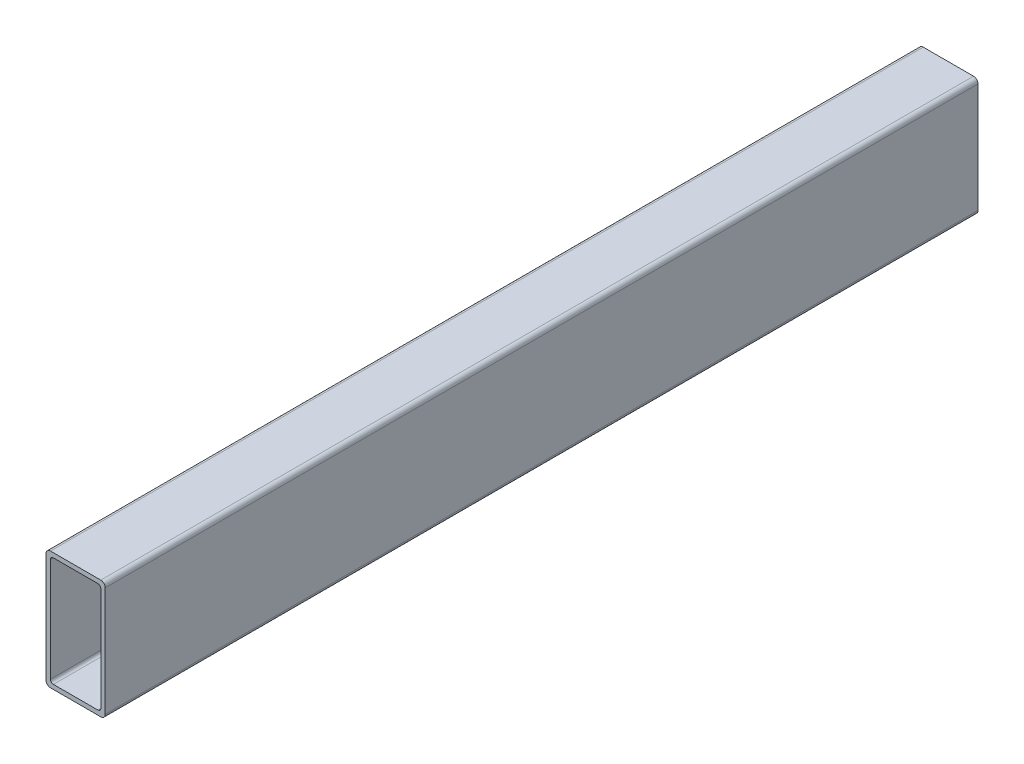
ISO-10303-21;
HEADER;
FILE_DESCRIPTION(('STEP AP214'),'2;1');
FILE_NAME('part.step','',(''),(''),'','','');
FILE_SCHEMA(('AUTOMOTIVE_DESIGN { 1 0 10303 214 1 1 1 1 }'));
ENDSEC;
DATA;
#1=APPLICATION_CONTEXT('core data for automotive mechanical design processes');
#2=APPLICATION_PROTOCOL_DEFINITION('international standard','automotive_design',2000,#1);
#3=PRODUCT_CONTEXT('',#1,'mechanical');
#4=PRODUCT('Part','Part','',(#3));
#5=PRODUCT_RELATED_PRODUCT_CATEGORY('part','',(#4));
#6=PRODUCT_DEFINITION_FORMATION('','',#4);
#7=PRODUCT_DEFINITION_CONTEXT('part definition',#1,'design');
#8=PRODUCT_DEFINITION('design','',#6,#7);
#9=PRODUCT_DEFINITION_SHAPE('','',#8);
#10=(LENGTH_UNIT() NAMED_UNIT(*) SI_UNIT(.MILLI.,.METRE.));
#11=(NAMED_UNIT(*) PLANE_ANGLE_UNIT() SI_UNIT($,.RADIAN.));
#12=(NAMED_UNIT(*) SI_UNIT($,.STERADIAN.) SOLID_ANGLE_UNIT());
#13=UNCERTAINTY_MEASURE_WITH_UNIT(LENGTH_MEASURE(1.E-05),#10,'distance_accuracy_value','');
#14=(GEOMETRIC_REPRESENTATION_CONTEXT(3) GLOBAL_UNCERTAINTY_ASSIGNED_CONTEXT((#13)) GLOBAL_UNIT_ASSIGNED_CONTEXT((#10,
#11,#12)) REPRESENTATION_CONTEXT('',''));
#15=CARTESIAN_POINT('',(0.,0.,0.));
#16=DIRECTION('',(0.,0.,1.));
#17=DIRECTION('',(1.,0.,0.));
#18=AXIS2_PLACEMENT_3D('',#15,#16,#17);
#19=CARTESIAN_POINT('',(0.,1.50000000000036,349.454556998328));
#20=DIRECTION('',(1.,0.,0.));
#21=DIRECTION('',(0.,1.,0.));
#22=AXIS2_PLACEMENT_3D('',#19,#20,#21);
#23=PLANE('',#22);
#24=DIRECTION('',(0.,-1.,0.));
#25=VECTOR('',#24,1.);
#26=CARTESIAN_POINT('',(0.,1.50000000000036,294.733197448332));
#27=LINE('',#26,#25);
#28=CARTESIAN_POINT('',(0.,38.5000000000004,294.733197448332));
#29=VERTEX_POINT('',#28);
#30=CARTESIAN_POINT('',(0.,1.50000000000036,294.733197448332));
#31=VERTEX_POINT('',#30);
#32=EDGE_CURVE('E306',#29,#31,#27,.T.);
#33=ORIENTED_EDGE('',*,*,#32,.F.);
#34=DIRECTION('',(0.,0.,-1.));
#35=VECTOR('',#34,1.);
#36=CARTESIAN_POINT('',(0.,38.5000000000004,349.454556998328));
#37=LINE('',#36,#35);
#38=CARTESIAN_POINT('',(0.,38.5000000000004,0.));
#39=VERTEX_POINT('',#38);
#40=EDGE_CURVE('E50',#29,#39,#37,.T.);
#41=ORIENTED_EDGE('',*,*,#40,.T.);
#42=DIRECTION('',(0.,-1.,0.));
#43=VECTOR('',#42,1.);
#44=CARTESIAN_POINT('',(0.,1.50000000000036,0.));
#45=LINE('',#44,#43);
#46=CARTESIAN_POINT('',(0.,1.50000000000036,0.));
#47=VERTEX_POINT('',#46);
#48=EDGE_CURVE('E201',#39,#47,#45,.T.);
#49=ORIENTED_EDGE('',*,*,#48,.T.);
#50=DIRECTION('',(0.,0.,-1.));
#51=VECTOR('',#50,1.);
#52=CARTESIAN_POINT('',(0.,1.50000000000036,349.454556998328));
#53=LINE('',#52,#51);
#54=EDGE_CURVE('E204',#31,#47,#53,.T.);
#55=ORIENTED_EDGE('',*,*,#54,.F.);
#56=EDGE_LOOP('',(#33,#41,#49,#55));
#57=FACE_BOUND('',#56,.T.);
#58=ADVANCED_FACE('F35',(#57),#23,.F.);
#59=CARTESIAN_POINT('',(1.5,38.5000000000004,349.454556998328));
#60=DIRECTION('',(0.,0.,-1.));
#61=DIRECTION('',(-1.,0.,0.));
#62=AXIS2_PLACEMENT_3D('',#59,#60,#61);
#63=CYLINDRICAL_SURFACE('',#62,1.5);
#64=CARTESIAN_POINT('',(1.5,38.5000000000004,294.733197448332));
#65=DIRECTION('',(0.,0.,1.));
#66=DIRECTION('',(1.,0.,0.));
#67=AXIS2_PLACEMENT_3D('',#64,#65,#66);
#68=CIRCLE('',#67,1.5);
#69=CARTESIAN_POINT('',(1.50000000000002,40.0000000000004,294.733197448332));
#70=VERTEX_POINT('',#69);
#71=EDGE_CURVE('E242',#70,#29,#68,.T.);
#72=ORIENTED_EDGE('',*,*,#71,.F.);
#73=DIRECTION('',(0.,0.,-1.));
#74=VECTOR('',#73,1.);
#75=CARTESIAN_POINT('',(1.50000000000002,40.0000000000004,349.454556998328));
#76=LINE('',#75,#74);
#77=CARTESIAN_POINT('',(1.50000000000002,40.0000000000004,0.));
#78=VERTEX_POINT('',#77);
#79=EDGE_CURVE('E207',#70,#78,#76,.T.);
#80=ORIENTED_EDGE('',*,*,#79,.T.);
#81=CARTESIAN_POINT('',(1.5,38.5000000000004,0.));
#82=DIRECTION('',(0.,0.,1.));
#83=DIRECTION('',(-1.,0.,0.));
#84=AXIS2_PLACEMENT_3D('',#81,#82,#83);
#85=CIRCLE('',#84,1.5);
#86=EDGE_CURVE('E199',#78,#39,#85,.T.);
#87=ORIENTED_EDGE('',*,*,#86,.T.);
#88=ORIENTED_EDGE('',*,*,#40,.F.);
#89=EDGE_LOOP('',(#72,#80,#87,#88));
#90=FACE_BOUND('',#89,.T.);
#91=ADVANCED_FACE('F239',(#90),#63,.T.);
#92=CARTESIAN_POINT('',(18.5,40.0000000000004,349.454556998328));
#93=DIRECTION('',(0.,-1.,0.));
#94=DIRECTION('',(0.,0.,-1.));
#95=AXIS2_PLACEMENT_3D('',#92,#93,#94);
#96=PLANE('',#95);
#97=DIRECTION('',(-1.,0.,0.));
#98=VECTOR('',#97,1.);
#99=CARTESIAN_POINT('',(18.5,40.0000000000004,294.733197448332));
#100=LINE('',#99,#98);
#101=CARTESIAN_POINT('',(18.5,40.0000000000004,294.733197448332));
#102=VERTEX_POINT('',#101);
#103=EDGE_CURVE('E247',#102,#70,#100,.T.);
#104=ORIENTED_EDGE('',*,*,#103,.F.);
#105=DIRECTION('',(0.,0.,-1.));
#106=VECTOR('',#105,1.);
#107=CARTESIAN_POINT('',(18.5,40.0000000000004,349.454556998328));
#108=LINE('',#107,#106);
#109=CARTESIAN_POINT('',(18.5,40.0000000000004,0.));
#110=VERTEX_POINT('',#109);
#111=EDGE_CURVE('E209',#102,#110,#108,.T.);
#112=ORIENTED_EDGE('',*,*,#111,.T.);
#113=DIRECTION('',(-1.,0.,0.));
#114=VECTOR('',#113,1.);
#115=CARTESIAN_POINT('',(18.5,40.0000000000004,0.));
#116=LINE('',#115,#114);
#117=EDGE_CURVE('E196',#110,#78,#116,.T.);
#118=ORIENTED_EDGE('',*,*,#117,.T.);
#119=ORIENTED_EDGE('',*,*,#79,.F.);
#120=EDGE_LOOP('',(#104,#112,#118,#119));
#121=FACE_BOUND('',#120,.T.);
#122=ADVANCED_FACE('F245',(#121),#96,.F.);
#123=CARTESIAN_POINT('',(18.5,38.5000000000004,349.454556998328));
#124=DIRECTION('',(0.,0.,-1.));
#125=DIRECTION('',(-1.,0.,0.));
#126=AXIS2_PLACEMENT_3D('',#123,#124,#125);
#127=CYLINDRICAL_SURFACE('',#126,1.5);
#128=CARTESIAN_POINT('',(18.5,38.5000000000004,294.733197448332));
#129=DIRECTION('',(0.,0.,1.));
#130=DIRECTION('',(1.,0.,0.));
#131=AXIS2_PLACEMENT_3D('',#128,#129,#130);
#132=CIRCLE('',#131,1.5);
#133=CARTESIAN_POINT('',(20.,38.5000000000004,294.733197448332));
#134=VERTEX_POINT('',#133);
#135=EDGE_CURVE('E310',#134,#102,#132,.T.);
#136=ORIENTED_EDGE('',*,*,#135,.F.);
#137=DIRECTION('',(0.,0.,-1.));
#138=VECTOR('',#137,1.);
#139=CARTESIAN_POINT('',(20.,38.5000000000004,349.454556998328));
#140=LINE('',#139,#138);
#141=CARTESIAN_POINT('',(20.,38.5000000000004,0.));
#142=VERTEX_POINT('',#141);
#143=EDGE_CURVE('E211',#134,#142,#140,.T.);
#144=ORIENTED_EDGE('',*,*,#143,.T.);
#145=CARTESIAN_POINT('',(18.5,38.5000000000004,0.));
#146=DIRECTION('',(0.,0.,1.));
#147=DIRECTION('',(1.,0.,0.));
#148=AXIS2_PLACEMENT_3D('',#145,#146,#147);
#149=CIRCLE('',#148,1.5);
#150=EDGE_CURVE('E193',#142,#110,#149,.T.);
#151=ORIENTED_EDGE('',*,*,#150,.T.);
#152=ORIENTED_EDGE('',*,*,#111,.F.);
#153=EDGE_LOOP('',(#136,#144,#151,#152));
#154=FACE_BOUND('',#153,.T.);
#155=ADVANCED_FACE('F250',(#154),#127,.T.);
#156=CARTESIAN_POINT('',(20.,1.50000000000036,349.454556998328));
#157=DIRECTION('',(-1.,0.,0.));
#158=DIRECTION('',(0.,-1.,0.));
#159=AXIS2_PLACEMENT_3D('',#156,#157,#158);
#160=PLANE('',#159);
#161=DIRECTION('',(0.,1.,0.));
#162=VECTOR('',#161,1.);
#163=CARTESIAN_POINT('',(20.,1.50000000000036,294.733197448332));
#164=LINE('',#163,#162);
#165=CARTESIAN_POINT('',(20.,1.50000000000036,294.733197448332));
#166=VERTEX_POINT('',#165);
#167=EDGE_CURVE('E256',#166,#134,#164,.T.);
#168=ORIENTED_EDGE('',*,*,#167,.F.);
#169=DIRECTION('',(0.,0.,-1.));
#170=VECTOR('',#169,1.);
#171=CARTESIAN_POINT('',(20.,1.50000000000036,349.454556998328));
#172=LINE('',#171,#170);
#173=CARTESIAN_POINT('',(20.,1.50000000000036,0.));
#174=VERTEX_POINT('',#173);
#175=EDGE_CURVE('E213',#166,#174,#172,.T.);
#176=ORIENTED_EDGE('',*,*,#175,.T.);
#177=DIRECTION('',(0.,1.,0.));
#178=VECTOR('',#177,1.);
#179=CARTESIAN_POINT('',(20.,1.50000000000036,0.));
#180=LINE('',#179,#178);
#181=EDGE_CURVE('E190',#174,#142,#180,.T.);
#182=ORIENTED_EDGE('',*,*,#181,.T.);
#183=ORIENTED_EDGE('',*,*,#143,.F.);
#184=EDGE_LOOP('',(#168,#176,#182,#183));
#185=FACE_BOUND('',#184,.T.);
#186=ADVANCED_FACE('F253',(#185),#160,.F.);
#187=CARTESIAN_POINT('',(18.5,1.50000000000036,349.454556998328));
#188=DIRECTION('',(0.,0.,-1.));
#189=DIRECTION('',(-1.,0.,0.));
#190=AXIS2_PLACEMENT_3D('',#187,#188,#189);
#191=CYLINDRICAL_SURFACE('',#190,1.50000000000001);
#192=CARTESIAN_POINT('',(18.5,1.50000000000036,294.733197448332));
#193=DIRECTION('',(0.,0.,1.));
#194=DIRECTION('',(1.,0.,0.));
#195=AXIS2_PLACEMENT_3D('',#192,#193,#194);
#196=CIRCLE('',#195,1.50000000000001);
#197=CARTESIAN_POINT('',(18.5,3.46944695195361E-13,294.733197448332));
#198=VERTEX_POINT('',#197);
#199=EDGE_CURVE('E260',#198,#166,#196,.T.);
#200=ORIENTED_EDGE('',*,*,#199,.F.);
#201=DIRECTION('',(0.,0.,-1.));
#202=VECTOR('',#201,1.);
#203=CARTESIAN_POINT('',(18.5,3.46944695195361E-13,349.454556998328));
#204=LINE('',#203,#202);
#205=CARTESIAN_POINT('',(18.5,3.46944695195361E-13,0.));
#206=VERTEX_POINT('',#205);
#207=EDGE_CURVE('E215',#198,#206,#204,.T.);
#208=ORIENTED_EDGE('',*,*,#207,.T.);
#209=CARTESIAN_POINT('',(18.5,1.50000000000036,0.));
#210=DIRECTION('',(0.,0.,1.));
#211=DIRECTION('',(-1.,0.,0.));
#212=AXIS2_PLACEMENT_3D('',#209,#210,#211);
#213=CIRCLE('',#212,1.50000000000001);
#214=EDGE_CURVE('E187',#206,#174,#213,.T.);
#215=ORIENTED_EDGE('',*,*,#214,.T.);
#216=ORIENTED_EDGE('',*,*,#175,.F.);
#217=EDGE_LOOP('',(#200,#208,#215,#216));
#218=FACE_BOUND('',#217,.T.);
#219=ADVANCED_FACE('F259',(#218),#191,.T.);
#220=CARTESIAN_POINT('',(18.5,3.46944695195361E-13,349.454556998328));
#221=DIRECTION('',(0.,1.,0.));
#222=DIRECTION('',(0.,0.,1.));
#223=AXIS2_PLACEMENT_3D('',#220,#221,#222);
#224=PLANE('',#223);
#225=DIRECTION('',(1.,0.,0.));
#226=VECTOR('',#225,1.);
#227=CARTESIAN_POINT('',(18.5,3.46944695195361E-13,294.733197448332));
#228=LINE('',#227,#226);
#229=CARTESIAN_POINT('',(1.50000000000002,3.46944695195361E-13,294.733197448332));
#230=VERTEX_POINT('',#229);
#231=EDGE_CURVE('E223',#230,#198,#228,.T.);
#232=ORIENTED_EDGE('',*,*,#231,.F.);
#233=DIRECTION('',(0.,0.,-1.));
#234=VECTOR('',#233,1.);
#235=CARTESIAN_POINT('',(1.50000000000002,3.46944695195361E-13,349.454556998328));
#236=LINE('',#235,#234);
#237=CARTESIAN_POINT('',(1.50000000000002,3.46944695195361E-13,0.));
#238=VERTEX_POINT('',#237);
#239=EDGE_CURVE('E43',#230,#238,#236,.T.);
#240=ORIENTED_EDGE('',*,*,#239,.T.);
#241=DIRECTION('',(1.,0.,0.));
#242=VECTOR('',#241,1.);
#243=CARTESIAN_POINT('',(18.5,3.46944695195361E-13,0.));
#244=LINE('',#243,#242);
#245=EDGE_CURVE('E184',#238,#206,#244,.T.);
#246=ORIENTED_EDGE('',*,*,#245,.T.);
#247=ORIENTED_EDGE('',*,*,#207,.F.);
#248=EDGE_LOOP('',(#232,#240,#246,#247));
#249=FACE_BOUND('',#248,.T.);
#250=ADVANCED_FACE('F219',(#249),#224,.F.);
#251=CARTESIAN_POINT('',(1.5,1.50000000000036,349.454556998328));
#252=DIRECTION('',(0.,0.,-1.));
#253=DIRECTION('',(-1.,0.,0.));
#254=AXIS2_PLACEMENT_3D('',#251,#252,#253);
#255=CYLINDRICAL_SURFACE('',#254,1.5);
#256=CARTESIAN_POINT('',(1.5,1.50000000000036,294.733197448332));
#257=DIRECTION('',(0.,0.,1.));
#258=DIRECTION('',(1.,0.,0.));
#259=AXIS2_PLACEMENT_3D('',#256,#257,#258);
#260=CIRCLE('',#259,1.5);
#261=EDGE_CURVE('E233',#31,#230,#260,.T.);
#262=ORIENTED_EDGE('',*,*,#261,.F.);
#263=ORIENTED_EDGE('',*,*,#54,.T.);
#264=CARTESIAN_POINT('',(1.5,1.50000000000036,0.));
#265=DIRECTION('',(0.,0.,1.));
#266=DIRECTION('',(-1.,0.,0.));
#267=AXIS2_PLACEMENT_3D('',#264,#265,#266);
#268=CIRCLE('',#267,1.5);
#269=EDGE_CURVE('E181',#47,#238,#268,.T.);
#270=ORIENTED_EDGE('',*,*,#269,.T.);
#271=ORIENTED_EDGE('',*,*,#239,.F.);
#272=EDGE_LOOP('',(#262,#263,#270,#271));
#273=FACE_BOUND('',#272,.T.);
#274=ADVANCED_FACE('F37',(#273),#255,.T.);
#275=CARTESIAN_POINT('',(1.5,1.50000000000036,0.));
#276=DIRECTION('',(0.,0.,-1.));
#277=DIRECTION('',(-1.,0.,0.));
#278=AXIS2_PLACEMENT_3D('',#275,#276,#277);
#279=PLANE('',#278);
#280=ORIENTED_EDGE('',*,*,#269,.F.);
#281=ORIENTED_EDGE('',*,*,#48,.F.);
#282=ORIENTED_EDGE('',*,*,#86,.F.);
#283=ORIENTED_EDGE('',*,*,#117,.F.);
#284=ORIENTED_EDGE('',*,*,#150,.F.);
#285=ORIENTED_EDGE('',*,*,#181,.F.);
#286=ORIENTED_EDGE('',*,*,#214,.F.);
#287=ORIENTED_EDGE('',*,*,#245,.F.);
#288=EDGE_LOOP('',(#280,#281,#282,#283,#284,#285,#286,#287));
#289=FACE_BOUND('',#288,.T.);
#290=DIRECTION('',(-1.,0.,0.));
#291=VECTOR('',#290,1.);
#292=CARTESIAN_POINT('',(17.5,38.5000000000004,0.));
#293=LINE('',#292,#291);
#294=CARTESIAN_POINT('',(17.5,38.5000000000004,0.));
#295=VERTEX_POINT('',#294);
#296=CARTESIAN_POINT('',(2.5,38.5000000000003,0.));
#297=VERTEX_POINT('',#296);
#298=EDGE_CURVE('E163',#295,#297,#293,.T.);
#299=ORIENTED_EDGE('',*,*,#298,.T.);
#300=CARTESIAN_POINT('',(2.5,37.5000000000004,0.));
#301=DIRECTION('',(0.,0.,1.));
#302=DIRECTION('',(-1.,0.,0.));
#303=AXIS2_PLACEMENT_3D('',#300,#301,#302);
#304=CIRCLE('',#303,0.999999999999994);
#305=CARTESIAN_POINT('',(1.5,37.5000000000004,0.));
#306=VERTEX_POINT('',#305);
#307=EDGE_CURVE('E262',#297,#306,#304,.T.);
#308=ORIENTED_EDGE('',*,*,#307,.T.);
#309=DIRECTION('',(0.,-1.,0.));
#310=VECTOR('',#309,1.);
#311=CARTESIAN_POINT('',(1.5,2.50000000000036,0.));
#312=LINE('',#311,#310);
#313=CARTESIAN_POINT('',(1.5,2.50000000000036,0.));
#314=VERTEX_POINT('',#313);
#315=EDGE_CURVE('E269',#306,#314,#312,.T.);
#316=ORIENTED_EDGE('',*,*,#315,.T.);
#317=CARTESIAN_POINT('',(2.5,2.50000000000036,0.));
#318=DIRECTION('',(0.,0.,1.));
#319=DIRECTION('',(-1.,0.,0.));
#320=AXIS2_PLACEMENT_3D('',#317,#318,#319);
#321=CIRCLE('',#320,1.);
#322=CARTESIAN_POINT('',(2.5,1.50000000000035,0.));
#323=VERTEX_POINT('',#322);
#324=EDGE_CURVE('E272',#314,#323,#321,.T.);
#325=ORIENTED_EDGE('',*,*,#324,.T.);
#326=DIRECTION('',(1.,0.,0.));
#327=VECTOR('',#326,1.);
#328=CARTESIAN_POINT('',(17.5,1.50000000000036,0.));
#329=LINE('',#328,#327);
#330=CARTESIAN_POINT('',(17.5,1.50000000000036,0.));
#331=VERTEX_POINT('',#330);
#332=EDGE_CURVE('E275',#323,#331,#329,.T.);
#333=ORIENTED_EDGE('',*,*,#332,.T.);
#334=CARTESIAN_POINT('',(17.5,2.50000000000036,0.));
#335=DIRECTION('',(0.,0.,1.));
#336=DIRECTION('',(-1.,0.,0.));
#337=AXIS2_PLACEMENT_3D('',#334,#335,#336);
#338=CIRCLE('',#337,1.);
#339=CARTESIAN_POINT('',(18.5,2.50000000000036,0.));
#340=VERTEX_POINT('',#339);
#341=EDGE_CURVE('E278',#331,#340,#338,.T.);
#342=ORIENTED_EDGE('',*,*,#341,.T.);
#343=DIRECTION('',(0.,1.,0.));
#344=VECTOR('',#343,1.);
#345=CARTESIAN_POINT('',(18.5,2.50000000000036,0.));
#346=LINE('',#345,#344);
#347=CARTESIAN_POINT('',(18.5,37.5000000000004,0.));
#348=VERTEX_POINT('',#347);
#349=EDGE_CURVE('E281',#340,#348,#346,.T.);
#350=ORIENTED_EDGE('',*,*,#349,.T.);
#351=CARTESIAN_POINT('',(17.5,37.5000000000004,0.));
#352=DIRECTION('',(0.,0.,1.));
#353=DIRECTION('',(1.,0.,0.));
#354=AXIS2_PLACEMENT_3D('',#351,#352,#353);
#355=CIRCLE('',#354,0.999999999999997);
#356=EDGE_CURVE('E284',#348,#295,#355,.T.);
#357=ORIENTED_EDGE('',*,*,#356,.T.);
#358=EDGE_LOOP('',(#299,#308,#316,#325,#333,#342,#350,#357));
#359=FACE_BOUND('',#358,.T.);
#360=ADVANCED_FACE('F229',(#289,#359),#279,.T.);
#361=CARTESIAN_POINT('',(17.5,38.5000000000004,349.454556998328));
#362=DIRECTION('',(0.,-1.,0.));
#363=DIRECTION('',(1.,0.,0.));
#364=AXIS2_PLACEMENT_3D('',#361,#362,#363);
#365=PLANE('',#364);
#366=DIRECTION('',(0.,0.,-1.));
#367=VECTOR('',#366,1.);
#368=CARTESIAN_POINT('',(17.5,38.5000000000004,349.454556998328));
#369=LINE('',#368,#367);
#370=CARTESIAN_POINT('',(17.5,38.5000000000004,294.733197448332));
#371=VERTEX_POINT('',#370);
#372=EDGE_CURVE('E155',#371,#295,#369,.T.);
#373=ORIENTED_EDGE('',*,*,#372,.F.);
#374=DIRECTION('',(-1.,0.,0.));
#375=VECTOR('',#374,1.);
#376=CARTESIAN_POINT('',(17.5,38.5000000000004,294.733197448332));
#377=LINE('',#376,#375);
#378=CARTESIAN_POINT('',(2.5,38.5000000000003,294.733197448332));
#379=VERTEX_POINT('',#378);
#380=EDGE_CURVE('E12',#371,#379,#377,.T.);
#381=ORIENTED_EDGE('',*,*,#380,.T.);
#382=DIRECTION('',(0.,0.,-1.));
#383=VECTOR('',#382,1.);
#384=CARTESIAN_POINT('',(2.5,38.5000000000003,349.454556998328));
#385=LINE('',#384,#383);
#386=EDGE_CURVE('E165',#379,#297,#385,.T.);
#387=ORIENTED_EDGE('',*,*,#386,.T.);
#388=ORIENTED_EDGE('',*,*,#298,.F.);
#389=EDGE_LOOP('',(#373,#381,#387,#388));
#390=FACE_BOUND('',#389,.T.);
#391=ADVANCED_FACE('F161',(#390),#365,.T.);
#392=CARTESIAN_POINT('',(17.5,37.5000000000004,349.454556998328));
#393=DIRECTION('',(0.,0.,-1.));
#394=DIRECTION('',(-1.,0.,0.));
#395=AXIS2_PLACEMENT_3D('',#392,#393,#394);
#396=CYLINDRICAL_SURFACE('',#395,0.999999999999997);
#397=DIRECTION('',(0.,0.,-1.));
#398=VECTOR('',#397,1.);
#399=CARTESIAN_POINT('',(18.5,37.5000000000004,349.454556998328));
#400=LINE('',#399,#398);
#401=CARTESIAN_POINT('',(18.5,37.5000000000004,294.733197448332));
#402=VERTEX_POINT('',#401);
#403=EDGE_CURVE('E157',#402,#348,#400,.T.);
#404=ORIENTED_EDGE('',*,*,#403,.F.);
#405=CARTESIAN_POINT('',(17.5,37.5000000000004,294.733197448332));
#406=DIRECTION('',(0.,0.,1.));
#407=DIRECTION('',(1.,0.,0.));
#408=AXIS2_PLACEMENT_3D('',#405,#406,#407);
#409=CIRCLE('',#408,0.999999999999997);
#410=EDGE_CURVE('E148',#402,#371,#409,.T.);
#411=ORIENTED_EDGE('',*,*,#410,.T.);
#412=ORIENTED_EDGE('',*,*,#372,.T.);
#413=ORIENTED_EDGE('',*,*,#356,.F.);
#414=EDGE_LOOP('',(#404,#411,#412,#413));
#415=FACE_BOUND('',#414,.T.);
#416=ADVANCED_FACE('F153',(#415),#396,.F.);
#417=CARTESIAN_POINT('',(18.5,2.50000000000036,349.454556998328));
#418=DIRECTION('',(-1.,0.,0.));
#419=DIRECTION('',(0.,-1.,0.));
#420=AXIS2_PLACEMENT_3D('',#417,#418,#419);
#421=PLANE('',#420);
#422=DIRECTION('',(0.,0.,-1.));
#423=VECTOR('',#422,1.);
#424=CARTESIAN_POINT('',(18.5,2.50000000000036,349.454556998328));
#425=LINE('',#424,#423);
#426=CARTESIAN_POINT('',(18.5,2.50000000000036,294.733197448332));
#427=VERTEX_POINT('',#426);
#428=EDGE_CURVE('E167',#427,#340,#425,.T.);
#429=ORIENTED_EDGE('',*,*,#428,.F.);
#430=DIRECTION('',(0.,1.,0.));
#431=VECTOR('',#430,1.);
#432=CARTESIAN_POINT('',(18.5,2.50000000000036,294.733197448332));
#433=LINE('',#432,#431);
#434=EDGE_CURVE('E159',#427,#402,#433,.T.);
#435=ORIENTED_EDGE('',*,*,#434,.T.);
#436=ORIENTED_EDGE('',*,*,#403,.T.);
#437=ORIENTED_EDGE('',*,*,#349,.F.);
#438=EDGE_LOOP('',(#429,#435,#436,#437));
#439=FACE_BOUND('',#438,.T.);
#440=ADVANCED_FACE('F290',(#439),#421,.T.);
#441=CARTESIAN_POINT('',(17.5,2.50000000000036,349.454556998328));
#442=DIRECTION('',(0.,0.,-1.));
#443=DIRECTION('',(-1.,0.,0.));
#444=AXIS2_PLACEMENT_3D('',#441,#442,#443);
#445=CYLINDRICAL_SURFACE('',#444,1.);
#446=DIRECTION('',(0.,0.,-1.));
#447=VECTOR('',#446,1.);
#448=CARTESIAN_POINT('',(17.5,1.50000000000036,349.454556998328));
#449=LINE('',#448,#447);
#450=CARTESIAN_POINT('',(17.5,1.50000000000036,294.733197448332));
#451=VERTEX_POINT('',#450);
#452=EDGE_CURVE('E173',#451,#331,#449,.T.);
#453=ORIENTED_EDGE('',*,*,#452,.F.);
#454=CARTESIAN_POINT('',(17.5,2.50000000000036,294.733197448332));
#455=DIRECTION('',(0.,0.,1.));
#456=DIRECTION('',(1.,0.,0.));
#457=AXIS2_PLACEMENT_3D('',#454,#455,#456);
#458=CIRCLE('',#457,1.);
#459=EDGE_CURVE('E292',#451,#427,#458,.T.);
#460=ORIENTED_EDGE('',*,*,#459,.T.);
#461=ORIENTED_EDGE('',*,*,#428,.T.);
#462=ORIENTED_EDGE('',*,*,#341,.F.);
#463=EDGE_LOOP('',(#453,#460,#461,#462));
#464=FACE_BOUND('',#463,.T.);
#465=ADVANCED_FACE('F327',(#464),#445,.F.);
#466=CARTESIAN_POINT('',(17.5,1.50000000000036,349.454556998328));
#467=DIRECTION('',(0.,1.,0.));
#468=DIRECTION('',(-1.,0.,0.));
#469=AXIS2_PLACEMENT_3D('',#466,#467,#468);
#470=PLANE('',#469);
#471=DIRECTION('',(0.,0.,-1.));
#472=VECTOR('',#471,1.);
#473=CARTESIAN_POINT('',(2.5,1.50000000000035,349.454556998328));
#474=LINE('',#473,#472);
#475=CARTESIAN_POINT('',(2.5,1.50000000000035,294.733197448332));
#476=VERTEX_POINT('',#475);
#477=EDGE_CURVE('E175',#476,#323,#474,.T.);
#478=ORIENTED_EDGE('',*,*,#477,.F.);
#479=DIRECTION('',(1.,0.,0.));
#480=VECTOR('',#479,1.);
#481=CARTESIAN_POINT('',(17.5,1.50000000000036,294.733197448332));
#482=LINE('',#481,#480);
#483=EDGE_CURVE('E294',#476,#451,#482,.T.);
#484=ORIENTED_EDGE('',*,*,#483,.T.);
#485=ORIENTED_EDGE('',*,*,#452,.T.);
#486=ORIENTED_EDGE('',*,*,#332,.F.);
#487=EDGE_LOOP('',(#478,#484,#485,#486));
#488=FACE_BOUND('',#487,.T.);
#489=ADVANCED_FACE('F324',(#488),#470,.T.);
#490=CARTESIAN_POINT('',(2.5,2.50000000000036,349.454556998328));
#491=DIRECTION('',(0.,0.,-1.));
#492=DIRECTION('',(-1.,0.,0.));
#493=AXIS2_PLACEMENT_3D('',#490,#491,#492);
#494=CYLINDRICAL_SURFACE('',#493,1.);
#495=DIRECTION('',(0.,0.,-1.));
#496=VECTOR('',#495,1.);
#497=CARTESIAN_POINT('',(1.5,2.50000000000036,349.454556998328));
#498=LINE('',#497,#496);
#499=CARTESIAN_POINT('',(1.5,2.50000000000036,294.733197448332));
#500=VERTEX_POINT('',#499);
#501=EDGE_CURVE('E177',#500,#314,#498,.T.);
#502=ORIENTED_EDGE('',*,*,#501,.F.);
#503=CARTESIAN_POINT('',(2.5,2.50000000000036,294.733197448332));
#504=DIRECTION('',(0.,0.,1.));
#505=DIRECTION('',(1.,0.,0.));
#506=AXIS2_PLACEMENT_3D('',#503,#504,#505);
#507=CIRCLE('',#506,1.);
#508=EDGE_CURVE('E299',#500,#476,#507,.T.);
#509=ORIENTED_EDGE('',*,*,#508,.T.);
#510=ORIENTED_EDGE('',*,*,#477,.T.);
#511=ORIENTED_EDGE('',*,*,#324,.F.);
#512=EDGE_LOOP('',(#502,#509,#510,#511));
#513=FACE_BOUND('',#512,.T.);
#514=ADVANCED_FACE('F321',(#513),#494,.F.);
#515=CARTESIAN_POINT('',(1.5,2.50000000000036,349.454556998328));
#516=DIRECTION('',(1.,0.,0.));
#517=DIRECTION('',(0.,1.,0.));
#518=AXIS2_PLACEMENT_3D('',#515,#516,#517);
#519=PLANE('',#518);
#520=DIRECTION('',(0.,0.,-1.));
#521=VECTOR('',#520,1.);
#522=CARTESIAN_POINT('',(1.5,37.5000000000004,349.454556998328));
#523=LINE('',#522,#521);
#524=CARTESIAN_POINT('',(1.5,37.5000000000004,294.733197448332));
#525=VERTEX_POINT('',#524);
#526=EDGE_CURVE('E179',#525,#306,#523,.T.);
#527=ORIENTED_EDGE('',*,*,#526,.F.);
#528=DIRECTION('',(0.,-1.,0.));
#529=VECTOR('',#528,1.);
#530=CARTESIAN_POINT('',(1.5,2.50000000000036,294.733197448332));
#531=LINE('',#530,#529);
#532=EDGE_CURVE('E302',#525,#500,#531,.T.);
#533=ORIENTED_EDGE('',*,*,#532,.T.);
#534=ORIENTED_EDGE('',*,*,#501,.T.);
#535=ORIENTED_EDGE('',*,*,#315,.F.);
#536=EDGE_LOOP('',(#527,#533,#534,#535));
#537=FACE_BOUND('',#536,.T.);
#538=ADVANCED_FACE('F316',(#537),#519,.T.);
#539=CARTESIAN_POINT('',(2.5,37.5000000000004,349.454556998328));
#540=DIRECTION('',(0.,0.,-1.));
#541=DIRECTION('',(-1.,0.,0.));
#542=AXIS2_PLACEMENT_3D('',#539,#540,#541);
#543=CYLINDRICAL_SURFACE('',#542,0.999999999999994);
#544=ORIENTED_EDGE('',*,*,#386,.F.);
#545=CARTESIAN_POINT('',(2.5,37.5000000000004,294.733197448332));
#546=DIRECTION('',(0.,0.,1.));
#547=DIRECTION('',(1.,0.,0.));
#548=AXIS2_PLACEMENT_3D('',#545,#546,#547);
#549=CIRCLE('',#548,0.999999999999994);
#550=EDGE_CURVE('E58',#379,#525,#549,.T.);
#551=ORIENTED_EDGE('',*,*,#550,.T.);
#552=ORIENTED_EDGE('',*,*,#526,.T.);
#553=ORIENTED_EDGE('',*,*,#307,.F.);
#554=EDGE_LOOP('',(#544,#551,#552,#553));
#555=FACE_BOUND('',#554,.T.);
#556=ADVANCED_FACE('F312',(#555),#543,.F.);
#557=CARTESIAN_POINT('',(-14.,170.,294.733197448332));
#558=DIRECTION('',(0.,0.,1.));
#559=DIRECTION('',(1.,0.,0.));
#560=AXIS2_PLACEMENT_3D('',#557,#558,#559);
#561=PLANE('',#560);
#562=ORIENTED_EDGE('',*,*,#550,.F.);
#563=ORIENTED_EDGE('',*,*,#380,.F.);
#564=ORIENTED_EDGE('',*,*,#410,.F.);
#565=ORIENTED_EDGE('',*,*,#434,.F.);
#566=ORIENTED_EDGE('',*,*,#459,.F.);
#567=ORIENTED_EDGE('',*,*,#483,.F.);
#568=ORIENTED_EDGE('',*,*,#508,.F.);
#569=ORIENTED_EDGE('',*,*,#532,.F.);
#570=EDGE_LOOP('',(#562,#563,#564,#565,#566,#567,#568,#569));
#571=FACE_BOUND('',#570,.T.);
#572=ORIENTED_EDGE('',*,*,#32,.T.);
#573=ORIENTED_EDGE('',*,*,#261,.T.);
#574=ORIENTED_EDGE('',*,*,#231,.T.);
#575=ORIENTED_EDGE('',*,*,#199,.T.);
#576=ORIENTED_EDGE('',*,*,#167,.T.);
#577=ORIENTED_EDGE('',*,*,#135,.T.);
#578=ORIENTED_EDGE('',*,*,#103,.T.);
#579=ORIENTED_EDGE('',*,*,#71,.T.);
#580=EDGE_LOOP('',(#572,#573,#574,#575,#576,#577,#578,#579));
#581=FACE_BOUND('',#580,.T.);
#582=ADVANCED_FACE('F146',(#571,#581),#561,.T.);
#583=CLOSED_SHELL('',(#58,#91,#122,#155,#186,#219,#250,#274,#360,#391,#416,#440,#465,#489,#514,
#538,#556,#582));
#584=MANIFOLD_SOLID_BREP('B2',#583);
#585=ADVANCED_BREP_SHAPE_REPRESENTATION('',(#18,#584),#14);
#586=SHAPE_DEFINITION_REPRESENTATION(#9,#585);
ENDSEC;
END-ISO-10303-21;
